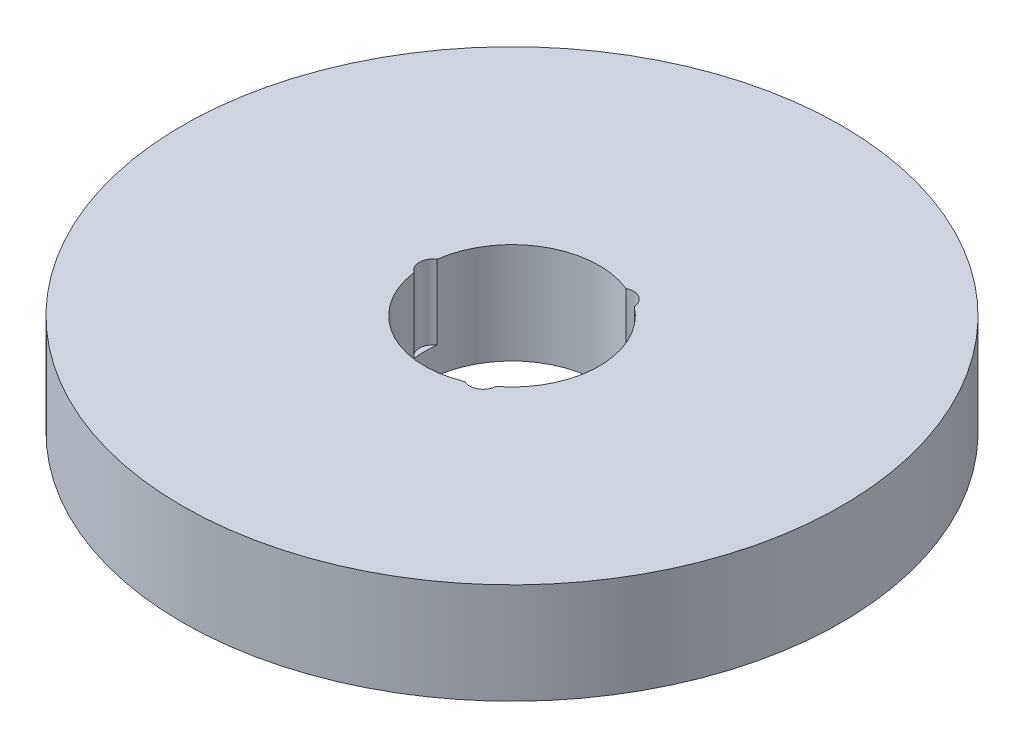
ISO-10303-21;
HEADER;
FILE_DESCRIPTION(('STEP AP214'),'2;1');
FILE_NAME('part.step','',(''),(''),'','','');
FILE_SCHEMA(('AUTOMOTIVE_DESIGN { 1 0 10303 214 1 1 1 1 }'));
ENDSEC;
DATA;
#1=APPLICATION_CONTEXT('core data for automotive mechanical design processes');
#2=APPLICATION_PROTOCOL_DEFINITION('international standard','automotive_design',2000,#1);
#3=PRODUCT_CONTEXT('',#1,'mechanical');
#4=PRODUCT('Part','Part','',(#3));
#5=PRODUCT_RELATED_PRODUCT_CATEGORY('part','',(#4));
#6=PRODUCT_DEFINITION_FORMATION('','',#4);
#7=PRODUCT_DEFINITION_CONTEXT('part definition',#1,'design');
#8=PRODUCT_DEFINITION('design','',#6,#7);
#9=PRODUCT_DEFINITION_SHAPE('','',#8);
#10=(LENGTH_UNIT() NAMED_UNIT(*) SI_UNIT(.MILLI.,.METRE.));
#11=(NAMED_UNIT(*) PLANE_ANGLE_UNIT() SI_UNIT($,.RADIAN.));
#12=(NAMED_UNIT(*) SI_UNIT($,.STERADIAN.) SOLID_ANGLE_UNIT());
#13=UNCERTAINTY_MEASURE_WITH_UNIT(LENGTH_MEASURE(1.E-05),#10,'distance_accuracy_value','');
#14=(GEOMETRIC_REPRESENTATION_CONTEXT(3) GLOBAL_UNCERTAINTY_ASSIGNED_CONTEXT((#13)) GLOBAL_UNIT_ASSIGNED_CONTEXT((#10,
#11,#12)) REPRESENTATION_CONTEXT('',''));
#15=CARTESIAN_POINT('',(0.,0.,0.));
#16=DIRECTION('',(0.,0.,1.));
#17=DIRECTION('',(1.,0.,0.));
#18=AXIS2_PLACEMENT_3D('',#15,#16,#17);
#19=CARTESIAN_POINT('',(0.,26.,0.));
#20=DIRECTION('',(0.,-1.,0.));
#21=DIRECTION('',(0.,0.,-1.));
#22=AXIS2_PLACEMENT_3D('',#19,#20,#21);
#23=CYLINDRICAL_SURFACE('',#22,85.);
#24=CARTESIAN_POINT('',(0.,26.,0.));
#25=DIRECTION('',(0.,1.,0.));
#26=DIRECTION('',(0.,0.,1.));
#27=AXIS2_PLACEMENT_3D('',#24,#25,#26);
#28=CIRCLE('',#27,85.);
#29=CARTESIAN_POINT('',(0.,26.,-85.));
#30=VERTEX_POINT('',#29);
#31=EDGE_CURVE('E130',#30,#30,#28,.T.);
#32=CARTESIAN_POINT('',(0.,0.,0.));
#33=DIRECTION('',(0.,1.,0.));
#34=DIRECTION('',(0.,0.,1.));
#35=AXIS2_PLACEMENT_3D('',#32,#33,#34);
#36=CIRCLE('',#35,85.);
#37=CARTESIAN_POINT('',(0.,0.,-85.));
#38=VERTEX_POINT('',#37);
#39=EDGE_CURVE('E117',#38,#38,#36,.T.);
#40=CARTESIAN_POINT('',(0.,26.,-85.));
#41=CARTESIAN_POINT('',(0.,25.7291666666667,-85.));
#42=CARTESIAN_POINT('',(0.,25.4583333333333,-85.));
#43=CARTESIAN_POINT('',(0.,24.9166666666667,-85.));
#44=CARTESIAN_POINT('',(0.,24.6458333333333,-85.));
#45=CARTESIAN_POINT('',(0.,24.1041666666667,-85.));
#46=CARTESIAN_POINT('',(0.,23.8333333333333,-85.));
#47=CARTESIAN_POINT('',(0.,23.2916666666667,-85.));
#48=CARTESIAN_POINT('',(0.,23.0208333333333,-85.));
#49=CARTESIAN_POINT('',(0.,22.4791666666667,-85.));
#50=CARTESIAN_POINT('',(0.,22.2083333333333,-85.));
#51=CARTESIAN_POINT('',(0.,21.6666666666667,-85.));
#52=CARTESIAN_POINT('',(0.,21.3958333333333,-85.));
#53=CARTESIAN_POINT('',(0.,20.8541666666667,-85.));
#54=CARTESIAN_POINT('',(0.,20.5833333333333,-85.));
#55=CARTESIAN_POINT('',(0.,20.0416666666667,-85.));
#56=CARTESIAN_POINT('',(0.,19.7708333333333,-85.));
#57=CARTESIAN_POINT('',(0.,19.2291666666667,-85.));
#58=CARTESIAN_POINT('',(0.,18.9583333333333,-85.));
#59=CARTESIAN_POINT('',(0.,18.4166666666667,-85.));
#60=CARTESIAN_POINT('',(0.,18.1458333333333,-85.));
#61=CARTESIAN_POINT('',(0.,17.6041666666667,-85.));
#62=CARTESIAN_POINT('',(0.,17.3333333333333,-85.));
#63=CARTESIAN_POINT('',(0.,16.7916666666667,-85.));
#64=CARTESIAN_POINT('',(0.,16.5208333333333,-85.));
#65=CARTESIAN_POINT('',(0.,15.9791666666667,-85.));
#66=CARTESIAN_POINT('',(0.,15.7083333333333,-85.));
#67=CARTESIAN_POINT('',(0.,15.1666666666667,-85.));
#68=CARTESIAN_POINT('',(0.,14.8958333333333,-85.));
#69=CARTESIAN_POINT('',(0.,14.3541666666667,-85.));
#70=CARTESIAN_POINT('',(0.,14.0833333333333,-85.));
#71=CARTESIAN_POINT('',(0.,13.5416666666667,-85.));
#72=CARTESIAN_POINT('',(0.,13.2708333333333,-85.));
#73=CARTESIAN_POINT('',(0.,12.7291666666667,-85.));
#74=CARTESIAN_POINT('',(0.,12.4583333333333,-85.));
#75=CARTESIAN_POINT('',(0.,11.9166666666667,-85.));
#76=CARTESIAN_POINT('',(0.,11.6458333333333,-85.));
#77=CARTESIAN_POINT('',(0.,11.1041666666667,-85.));
#78=CARTESIAN_POINT('',(0.,10.8333333333333,-85.));
#79=CARTESIAN_POINT('',(0.,10.2916666666667,-85.));
#80=CARTESIAN_POINT('',(0.,10.0208333333333,-85.));
#81=CARTESIAN_POINT('',(0.,9.47916666666667,-85.));
#82=CARTESIAN_POINT('',(0.,9.20833333333333,-85.));
#83=CARTESIAN_POINT('',(0.,8.66666666666667,-85.));
#84=CARTESIAN_POINT('',(0.,8.39583333333333,-85.));
#85=CARTESIAN_POINT('',(0.,7.85416666666667,-85.));
#86=CARTESIAN_POINT('',(0.,7.58333333333333,-85.));
#87=CARTESIAN_POINT('',(0.,7.04166666666667,-85.));
#88=CARTESIAN_POINT('',(0.,6.77083333333333,-85.));
#89=CARTESIAN_POINT('',(0.,6.22916666666667,-85.));
#90=CARTESIAN_POINT('',(0.,5.95833333333333,-85.));
#91=CARTESIAN_POINT('',(0.,5.41666666666667,-85.));
#92=CARTESIAN_POINT('',(0.,5.14583333333333,-85.));
#93=CARTESIAN_POINT('',(0.,4.60416666666667,-85.));
#94=CARTESIAN_POINT('',(0.,4.33333333333333,-85.));
#95=CARTESIAN_POINT('',(0.,3.79166666666667,-85.));
#96=CARTESIAN_POINT('',(0.,3.52083333333333,-85.));
#97=CARTESIAN_POINT('',(0.,2.97916666666667,-85.));
#98=CARTESIAN_POINT('',(0.,2.70833333333333,-85.));
#99=CARTESIAN_POINT('',(0.,2.16666666666667,-85.));
#100=CARTESIAN_POINT('',(0.,1.89583333333333,-85.));
#101=CARTESIAN_POINT('',(0.,1.35416666666667,-85.));
#102=CARTESIAN_POINT('',(0.,1.08333333333333,-85.));
#103=CARTESIAN_POINT('',(0.,0.541666666666667,-85.));
#104=CARTESIAN_POINT('',(0.,0.270833333333334,-85.));
#105=CARTESIAN_POINT('',(0.,0.,-85.));
#106=B_SPLINE_CURVE_WITH_KNOTS('',3,(#40,#41,#42,#43,#44,#45,#46,#47,#48,#49,#50,#51,#52,#53,
#54,#55,#56,#57,#58,#59,#60,#61,#62,#63,#64,#65,#66,#67,#68,#69,#70,#71,#72,#73,#74,#75,#76,#77,
#78,#79,#80,#81,#82,#83,#84,#85,#86,#87,#88,#89,#90,#91,#92,#93,#94,#95,#96,#97,#98,#99,#100,
#101,#102,#103,#104,#105),.UNSPECIFIED.,.F.,.F.,(4,2,2,2,2,2,2,2,2,2,2,2,2,2,2,2,2,2,2,2,2,2,2,
2,2,2,2,2,2,2,2,2,4),(0.,0.812500000000001,1.625,2.4375,3.25,4.0625,4.875,5.6875,6.5,7.3125,
8.125,8.9375,9.75,10.5625,11.375,12.1875,13.,13.8125,14.625,15.4375,16.25,17.0625,17.875,
18.6875,19.5,20.3125,21.125,21.9375,22.75,23.5625,24.375,25.1875,26.),.UNSPECIFIED.);
#107=EDGE_CURVE('BSEAM39',#30,#38,#106,.T.);
#108=ORIENTED_EDGE('',*,*,#31,.F.);
#109=ORIENTED_EDGE('',*,*,#39,.T.);
#110=ORIENTED_EDGE('',*,*,#107,.T.);
#111=ORIENTED_EDGE('',*,*,#107,.F.);
#112=EDGE_LOOP('',(#108,#110,#109,#111));
#113=FACE_BOUND('',#112,.T.);
#114=ADVANCED_FACE('F39',(#113),#23,.T.);
#115=CARTESIAN_POINT('',(0.,26.,0.));
#116=DIRECTION('',(0.,1.,0.));
#117=DIRECTION('',(0.,0.,1.));
#118=AXIS2_PLACEMENT_3D('',#115,#116,#117);
#119=PLANE('',#118);
#120=CARTESIAN_POINT('',(10.192806494296,26.,17.6544587198385));
#121=DIRECTION('',(0.,1.,0.));
#122=DIRECTION('',(0.866025403784436,0.,-0.500000000000004));
#123=AXIS2_PLACEMENT_3D('',#120,#121,#122);
#124=CIRCLE('',#123,3.51999601085642);
#125=CARTESIAN_POINT('',(8.59796309472093,26.,20.7924272421913));
#126=VERTEX_POINT('',#125);
#127=CARTESIAN_POINT('',(13.7077886507169,26.,17.8422680819249));
#128=VERTEX_POINT('',#127);
#129=EDGE_CURVE('E148',#126,#128,#124,.T.);
#130=ORIENTED_EDGE('',*,*,#129,.F.);
#131=CARTESIAN_POINT('',(0.,26.,0.));
#132=DIRECTION('',(0.,1.,0.));
#133=DIRECTION('',(0.,0.,1.));
#134=AXIS2_PLACEMENT_3D('',#131,#132,#133);
#135=CIRCLE('',#134,22.5);
#136=CARTESIAN_POINT('',(-22.3057517454377,26.,2.95015916026634));
#137=VERTEX_POINT('',#136);
#138=EDGE_CURVE('E113',#137,#126,#135,.T.);
#139=ORIENTED_EDGE('',*,*,#138,.F.);
#140=CARTESIAN_POINT('',(-20.3856129885918,26.,0.));
#141=DIRECTION('',(0.,1.,0.));
#142=DIRECTION('',(0.,0.,1.));
#143=AXIS2_PLACEMENT_3D('',#140,#141,#142);
#144=CIRCLE('',#143,3.51999601085642);
#145=CARTESIAN_POINT('',(-22.3057517454377,26.,-2.95015916026634));
#146=VERTEX_POINT('',#145);
#147=EDGE_CURVE('E125',#146,#137,#144,.T.);
#148=ORIENTED_EDGE('',*,*,#147,.F.);
#149=CARTESIAN_POINT('',(8.59796309472064,26.,-20.7924272421914));
#150=VERTEX_POINT('',#149);
#151=EDGE_CURVE('E107',#150,#146,#135,.T.);
#152=ORIENTED_EDGE('',*,*,#151,.F.);
#153=CARTESIAN_POINT('',(10.1928064942957,26.,-17.6544587198386));
#154=DIRECTION('',(0.,1.,0.));
#155=DIRECTION('',(-0.866025403784443,0.,-0.499999999999992));
#156=AXIS2_PLACEMENT_3D('',#153,#154,#155);
#157=CIRCLE('',#156,3.51999601085642);
#158=CARTESIAN_POINT('',(13.7077886507167,26.,-17.8422680819251));
#159=VERTEX_POINT('',#158);
#160=EDGE_CURVE('E95',#159,#150,#157,.T.);
#161=ORIENTED_EDGE('',*,*,#160,.F.);
#162=EDGE_CURVE('E106',#128,#159,#135,.T.);
#163=ORIENTED_EDGE('',*,*,#162,.F.);
#164=EDGE_LOOP('',(#130,#139,#148,#152,#161,#163));
#165=FACE_BOUND('',#164,.T.);
#166=ORIENTED_EDGE('',*,*,#31,.T.);
#167=EDGE_LOOP('',(#166));
#168=FACE_BOUND('',#167,.T.);
#169=ADVANCED_FACE('F102',(#165,#168),#119,.T.);
#170=CARTESIAN_POINT('',(0.,0.,0.));
#171=DIRECTION('',(0.,1.,0.));
#172=DIRECTION('',(0.,0.,1.));
#173=AXIS2_PLACEMENT_3D('',#170,#171,#172);
#174=PLANE('',#173);
#175=CARTESIAN_POINT('',(0.,0.,0.));
#176=DIRECTION('',(0.,1.,0.));
#177=DIRECTION('',(0.,0.,1.));
#178=AXIS2_PLACEMENT_3D('',#175,#176,#177);
#179=CIRCLE('',#178,22.5);
#180=CARTESIAN_POINT('',(0.,0.,22.5));
#181=VERTEX_POINT('',#180);
#182=EDGE_CURVE('E118',#181,#181,#179,.T.);
#183=ORIENTED_EDGE('',*,*,#182,.T.);
#184=EDGE_LOOP('',(#183));
#185=FACE_BOUND('',#184,.T.);
#186=ORIENTED_EDGE('',*,*,#39,.F.);
#187=EDGE_LOOP('',(#186));
#188=FACE_BOUND('',#187,.T.);
#189=ADVANCED_FACE('F161',(#185,#188),#174,.F.);
#190=CARTESIAN_POINT('',(0.,26.,0.));
#191=DIRECTION('',(0.,-1.,0.));
#192=DIRECTION('',(0.,0.,-1.));
#193=AXIS2_PLACEMENT_3D('',#190,#191,#192);
#194=CYLINDRICAL_SURFACE('',#193,22.5);
#195=DIRECTION('',(0.,1.,0.));
#196=VECTOR('',#195,1.);
#197=CARTESIAN_POINT('',(8.59796309472094,16.4081860190848,20.7924272421913));
#198=LINE('',#197,#196);
#199=CARTESIAN_POINT('',(8.59796309472093,6.81637203816952,20.7924272421913));
#200=VERTEX_POINT('',#199);
#201=EDGE_CURVE('E11',#200,#126,#198,.T.);
#202=ORIENTED_EDGE('',*,*,#201,.F.);
#203=CARTESIAN_POINT('',(0.,6.81637203816952,0.));
#204=DIRECTION('',(0.,1.,0.));
#205=DIRECTION('',(0.,0.,1.));
#206=AXIS2_PLACEMENT_3D('',#203,#204,#205);
#207=CIRCLE('',#206,22.5);
#208=CARTESIAN_POINT('',(13.7077886507169,6.81637203816952,17.8422680819249));
#209=VERTEX_POINT('',#208);
#210=EDGE_CURVE('E100',#200,#209,#207,.T.);
#211=ORIENTED_EDGE('',*,*,#210,.T.);
#212=DIRECTION('',(0.,1.,0.));
#213=VECTOR('',#212,1.);
#214=CARTESIAN_POINT('',(13.7077886507169,16.4081860190848,17.8422680819249));
#215=LINE('',#214,#213);
#216=EDGE_CURVE('E46',#128,#209,#215,.F.);
#217=ORIENTED_EDGE('',*,*,#216,.F.);
#218=ORIENTED_EDGE('',*,*,#162,.T.);
#219=DIRECTION('',(0.,1.,0.));
#220=VECTOR('',#219,1.);
#221=CARTESIAN_POINT('',(13.7077886507167,16.4081860190848,-17.8422680819251));
#222=LINE('',#221,#220);
#223=CARTESIAN_POINT('',(13.7077886507167,6.81637203816952,-17.8422680819251));
#224=VERTEX_POINT('',#223);
#225=EDGE_CURVE('E90',#224,#159,#222,.T.);
#226=ORIENTED_EDGE('',*,*,#225,.F.);
#227=CARTESIAN_POINT('',(0.,6.81637203816952,0.));
#228=DIRECTION('',(0.,1.,0.));
#229=DIRECTION('',(0.,0.,1.));
#230=AXIS2_PLACEMENT_3D('',#227,#228,#229);
#231=CIRCLE('',#230,22.5);
#232=CARTESIAN_POINT('',(8.59796309472064,6.81637203816952,-20.7924272421914));
#233=VERTEX_POINT('',#232);
#234=EDGE_CURVE('E143',#224,#233,#231,.T.);
#235=ORIENTED_EDGE('',*,*,#234,.T.);
#236=DIRECTION('',(0.,1.,0.));
#237=VECTOR('',#236,1.);
#238=CARTESIAN_POINT('',(8.59796309472065,16.4081860190848,-20.7924272421914));
#239=LINE('',#238,#237);
#240=EDGE_CURVE('E98',#150,#233,#239,.F.);
#241=ORIENTED_EDGE('',*,*,#240,.F.);
#242=ORIENTED_EDGE('',*,*,#151,.T.);
#243=DIRECTION('',(0.,1.,0.));
#244=VECTOR('',#243,1.);
#245=CARTESIAN_POINT('',(-22.3057517454377,16.4081860190848,-2.95015916026633));
#246=LINE('',#245,#244);
#247=CARTESIAN_POINT('',(-22.3057517454377,6.81637203816952,-2.95015916026634));
#248=VERTEX_POINT('',#247);
#249=EDGE_CURVE('E137',#248,#146,#246,.T.);
#250=ORIENTED_EDGE('',*,*,#249,.F.);
#251=CARTESIAN_POINT('',(0.,6.81637203816952,0.));
#252=DIRECTION('',(0.,1.,0.));
#253=DIRECTION('',(0.,0.,1.));
#254=AXIS2_PLACEMENT_3D('',#251,#252,#253);
#255=CIRCLE('',#254,22.5);
#256=CARTESIAN_POINT('',(-22.3057517454377,6.81637203816952,2.95015916026634));
#257=VERTEX_POINT('',#256);
#258=EDGE_CURVE('E128',#248,#257,#255,.T.);
#259=ORIENTED_EDGE('',*,*,#258,.T.);
#260=DIRECTION('',(0.,1.,0.));
#261=VECTOR('',#260,1.);
#262=CARTESIAN_POINT('',(-22.3057517454377,16.4081860190848,2.95015916026633));
#263=LINE('',#262,#261);
#264=EDGE_CURVE('E134',#137,#257,#263,.F.);
#265=ORIENTED_EDGE('',*,*,#264,.F.);
#266=ORIENTED_EDGE('',*,*,#138,.T.);
#267=EDGE_LOOP('',(#202,#211,#217,#218,#226,#235,#241,#242,#250,#259,#265,#266));
#268=FACE_BOUND('',#267,.T.);
#269=ORIENTED_EDGE('',*,*,#182,.F.);
#270=EDGE_LOOP('',(#269));
#271=FACE_BOUND('',#270,.T.);
#272=ADVANCED_FACE('F115',(#268,#271),#194,.F.);
#273=CARTESIAN_POINT('',(-20.3856129885918,6.81637203816952,0.));
#274=DIRECTION('',(0.,1.,0.));
#275=DIRECTION('',(0.,0.,1.));
#276=AXIS2_PLACEMENT_3D('',#273,#274,#275);
#277=CYLINDRICAL_SURFACE('',#276,3.51999601085642);
#278=ORIENTED_EDGE('',*,*,#249,.T.);
#279=ORIENTED_EDGE('',*,*,#147,.T.);
#280=ORIENTED_EDGE('',*,*,#264,.T.);
#281=CARTESIAN_POINT('',(-20.3856129885918,6.81637203816952,0.));
#282=DIRECTION('',(0.,1.,0.));
#283=DIRECTION('',(0.,0.,1.));
#284=AXIS2_PLACEMENT_3D('',#281,#282,#283);
#285=CIRCLE('',#284,3.51999601085642);
#286=EDGE_CURVE('E127',#248,#257,#285,.T.);
#287=ORIENTED_EDGE('',*,*,#286,.F.);
#288=EDGE_LOOP('',(#278,#279,#280,#287));
#289=FACE_BOUND('',#288,.T.);
#290=ADVANCED_FACE('F175',(#289),#277,.F.);
#291=CARTESIAN_POINT('',(-20.3856129885918,6.81637203816952,0.));
#292=DIRECTION('',(0.,1.,0.));
#293=DIRECTION('',(0.,0.,1.));
#294=AXIS2_PLACEMENT_3D('',#291,#292,#293);
#295=PLANE('',#294);
#296=ORIENTED_EDGE('',*,*,#286,.T.);
#297=ORIENTED_EDGE('',*,*,#258,.F.);
#298=EDGE_LOOP('',(#296,#297));
#299=FACE_BOUND('',#298,.T.);
#300=ADVANCED_FACE('F176',(#299),#295,.T.);
#301=CARTESIAN_POINT('',(10.1928064942957,6.81637203816952,-17.6544587198386));
#302=DIRECTION('',(0.,1.,0.));
#303=DIRECTION('',(0.,0.,1.));
#304=AXIS2_PLACEMENT_3D('',#301,#302,#303);
#305=CYLINDRICAL_SURFACE('',#304,3.51999601085642);
#306=ORIENTED_EDGE('',*,*,#225,.T.);
#307=ORIENTED_EDGE('',*,*,#160,.T.);
#308=ORIENTED_EDGE('',*,*,#240,.T.);
#309=CARTESIAN_POINT('',(10.1928064942957,6.81637203816952,-17.6544587198386));
#310=DIRECTION('',(0.,1.,0.));
#311=DIRECTION('',(-0.866025403784443,0.,-0.499999999999992));
#312=AXIS2_PLACEMENT_3D('',#309,#310,#311);
#313=CIRCLE('',#312,3.51999601085642);
#314=EDGE_CURVE('E56',#224,#233,#313,.T.);
#315=ORIENTED_EDGE('',*,*,#314,.F.);
#316=EDGE_LOOP('',(#306,#307,#308,#315));
#317=FACE_BOUND('',#316,.T.);
#318=ADVANCED_FACE('F93',(#317),#305,.F.);
#319=CARTESIAN_POINT('',(10.1928064942957,6.81637203816952,-17.6544587198386));
#320=DIRECTION('',(0.,1.,0.));
#321=DIRECTION('',(-0.866025403784443,0.,-0.499999999999992));
#322=AXIS2_PLACEMENT_3D('',#319,#320,#321);
#323=PLANE('',#322);
#324=ORIENTED_EDGE('',*,*,#314,.T.);
#325=ORIENTED_EDGE('',*,*,#234,.F.);
#326=EDGE_LOOP('',(#324,#325));
#327=FACE_BOUND('',#326,.T.);
#328=ADVANCED_FACE('F153',(#327),#323,.T.);
#329=CARTESIAN_POINT('',(10.192806494296,6.81637203816952,17.6544587198385));
#330=DIRECTION('',(0.,1.,0.));
#331=DIRECTION('',(0.,0.,1.));
#332=AXIS2_PLACEMENT_3D('',#329,#330,#331);
#333=CYLINDRICAL_SURFACE('',#332,3.51999601085642);
#334=ORIENTED_EDGE('',*,*,#201,.T.);
#335=ORIENTED_EDGE('',*,*,#129,.T.);
#336=ORIENTED_EDGE('',*,*,#216,.T.);
#337=CARTESIAN_POINT('',(10.192806494296,6.81637203816952,17.6544587198385));
#338=DIRECTION('',(0.,1.,0.));
#339=DIRECTION('',(0.866025403784436,0.,-0.500000000000004));
#340=AXIS2_PLACEMENT_3D('',#337,#338,#339);
#341=CIRCLE('',#340,3.51999601085642);
#342=EDGE_CURVE('E55',#200,#209,#341,.T.);
#343=ORIENTED_EDGE('',*,*,#342,.F.);
#344=EDGE_LOOP('',(#334,#335,#336,#343));
#345=FACE_BOUND('',#344,.T.);
#346=ADVANCED_FACE('F144',(#345),#333,.F.);
#347=CARTESIAN_POINT('',(10.192806494296,6.81637203816952,17.6544587198385));
#348=DIRECTION('',(0.,1.,0.));
#349=DIRECTION('',(0.866025403784436,0.,-0.500000000000004));
#350=AXIS2_PLACEMENT_3D('',#347,#348,#349);
#351=PLANE('',#350);
#352=ORIENTED_EDGE('',*,*,#342,.T.);
#353=ORIENTED_EDGE('',*,*,#210,.F.);
#354=EDGE_LOOP('',(#352,#353));
#355=FACE_BOUND('',#354,.T.);
#356=ADVANCED_FACE('F150',(#355),#351,.T.);
#357=CLOSED_SHELL('',(#114,#169,#189,#272,#290,#300,#318,#328,#346,#356));
#358=MANIFOLD_SOLID_BREP('B2',#357);
#359=ADVANCED_BREP_SHAPE_REPRESENTATION('',(#18,#358),#14);
#360=SHAPE_DEFINITION_REPRESENTATION(#9,#359);
ENDSEC;
END-ISO-10303-21;
